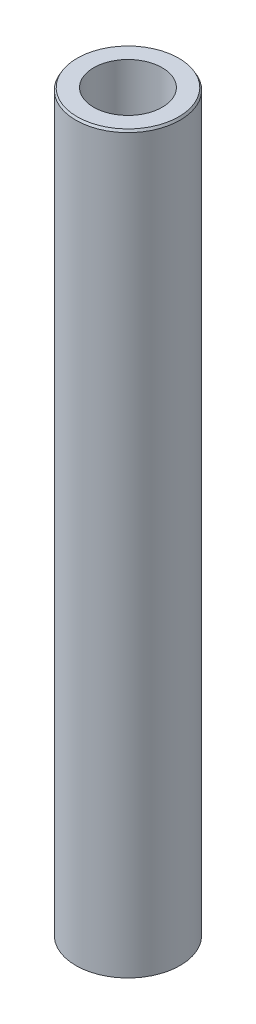
ISO-10303-21;
HEADER;
FILE_DESCRIPTION(('STEP AP214'),'2;1');
FILE_NAME('part.step','',(''),(''),'','','');
FILE_SCHEMA(('AUTOMOTIVE_DESIGN { 1 0 10303 214 1 1 1 1 }'));
ENDSEC;
DATA;
#1=APPLICATION_CONTEXT('core data for automotive mechanical design processes');
#2=APPLICATION_PROTOCOL_DEFINITION('international standard','automotive_design',2000,#1);
#3=PRODUCT_CONTEXT('',#1,'mechanical');
#4=PRODUCT('Part','Part','',(#3));
#5=PRODUCT_RELATED_PRODUCT_CATEGORY('part','',(#4));
#6=PRODUCT_DEFINITION_FORMATION('','',#4);
#7=PRODUCT_DEFINITION_CONTEXT('part definition',#1,'design');
#8=PRODUCT_DEFINITION('design','',#6,#7);
#9=PRODUCT_DEFINITION_SHAPE('','',#8);
#10=(LENGTH_UNIT() NAMED_UNIT(*) SI_UNIT(.MILLI.,.METRE.));
#11=(NAMED_UNIT(*) PLANE_ANGLE_UNIT() SI_UNIT($,.RADIAN.));
#12=(NAMED_UNIT(*) SI_UNIT($,.STERADIAN.) SOLID_ANGLE_UNIT());
#13=UNCERTAINTY_MEASURE_WITH_UNIT(LENGTH_MEASURE(1.E-05),#10,'distance_accuracy_value','');
#14=(GEOMETRIC_REPRESENTATION_CONTEXT(3) GLOBAL_UNCERTAINTY_ASSIGNED_CONTEXT((#13)) GLOBAL_UNIT_ASSIGNED_CONTEXT((#10,
#11,#12)) REPRESENTATION_CONTEXT('',''));
#15=CARTESIAN_POINT('',(0.,0.,0.));
#16=DIRECTION('',(0.,0.,1.));
#17=DIRECTION('',(1.,0.,0.));
#18=AXIS2_PLACEMENT_3D('',#15,#16,#17);
#19=CARTESIAN_POINT('',(0.,600.,0.));
#20=DIRECTION('',(0.,-1.,0.));
#21=DIRECTION('',(0.,0.,-1.));
#22=AXIS2_PLACEMENT_3D('',#19,#20,#21);
#23=CYLINDRICAL_SURFACE('',#22,42.5);
#24=CARTESIAN_POINT('',(0.,598.133978782126,0.));
#25=DIRECTION('',(0.,1.,0.));
#26=DIRECTION('',(0.,0.,1.));
#27=AXIS2_PLACEMENT_3D('',#24,#25,#26);
#28=CIRCLE('',#27,42.5);
#29=CARTESIAN_POINT('',(0.,598.133978782126,42.5));
#30=VERTEX_POINT('',#29);
#31=EDGE_CURVE('E50',#30,#30,#28,.F.);
#32=ORIENTED_EDGE('',*,*,#31,.T.);
#33=EDGE_LOOP('',(#32));
#34=FACE_BOUND('',#33,.T.);
#35=CARTESIAN_POINT('',(0.,1.07734785245284,0.));
#36=DIRECTION('',(0.,1.,0.));
#37=DIRECTION('',(0.,0.,1.));
#38=AXIS2_PLACEMENT_3D('',#35,#36,#37);
#39=CIRCLE('',#38,42.5);
#40=CARTESIAN_POINT('',(0.,1.07734785245284,42.5));
#41=VERTEX_POINT('',#40);
#42=EDGE_CURVE('E51',#41,#41,#39,.T.);
#43=ORIENTED_EDGE('',*,*,#42,.T.);
#44=EDGE_LOOP('',(#43));
#45=FACE_BOUND('',#44,.T.);
#46=ADVANCED_FACE('F39',(#34,#45),#23,.T.);
#47=CARTESIAN_POINT('',(0.,600.,0.));
#48=DIRECTION('',(0.,1.,0.));
#49=DIRECTION('',(0.,0.,1.));
#50=AXIS2_PLACEMENT_3D('',#47,#48,#49);
#51=PLANE('',#50);
#52=CARTESIAN_POINT('',(0.,600.,0.));
#53=DIRECTION('',(0.,1.,0.));
#54=DIRECTION('',(0.,0.,1.));
#55=AXIS2_PLACEMENT_3D('',#52,#53,#54);
#56=CIRCLE('',#55,41.4226521475471);
#57=CARTESIAN_POINT('',(0.,600.,41.4226521475471));
#58=VERTEX_POINT('',#57);
#59=EDGE_CURVE('E54',#58,#58,#56,.T.);
#60=ORIENTED_EDGE('',*,*,#59,.T.);
#61=EDGE_LOOP('',(#60));
#62=FACE_BOUND('',#61,.T.);
#63=CARTESIAN_POINT('',(0.,600.,0.));
#64=DIRECTION('',(0.,1.,0.));
#65=DIRECTION('',(0.,0.,1.));
#66=AXIS2_PLACEMENT_3D('',#63,#64,#65);
#67=CIRCLE('',#66,27.9580902125447);
#68=CARTESIAN_POINT('',(0.,600.,27.9580902125447));
#69=VERTEX_POINT('',#68);
#70=EDGE_CURVE('E58',#69,#69,#67,.T.);
#71=ORIENTED_EDGE('',*,*,#70,.F.);
#72=EDGE_LOOP('',(#71));
#73=FACE_BOUND('',#72,.T.);
#74=ADVANCED_FACE('F69',(#62,#73),#51,.T.);
#75=CARTESIAN_POINT('',(0.,0.,0.));
#76=DIRECTION('',(0.,1.,0.));
#77=DIRECTION('',(0.,0.,1.));
#78=AXIS2_PLACEMENT_3D('',#75,#76,#77);
#79=PLANE('',#78);
#80=CARTESIAN_POINT('',(0.,0.,0.));
#81=DIRECTION('',(0.,1.,0.));
#82=DIRECTION('',(0.,0.,1.));
#83=AXIS2_PLACEMENT_3D('',#80,#81,#82);
#84=CIRCLE('',#83,40.6339787821265);
#85=CARTESIAN_POINT('',(0.,0.,40.6339787821265));
#86=VERTEX_POINT('',#85);
#87=EDGE_CURVE('E10',#86,#86,#84,.F.);
#88=ORIENTED_EDGE('',*,*,#87,.T.);
#89=EDGE_LOOP('',(#88));
#90=FACE_BOUND('',#89,.T.);
#91=CARTESIAN_POINT('',(0.,0.,0.));
#92=DIRECTION('',(0.,1.,0.));
#93=DIRECTION('',(0.,0.,1.));
#94=AXIS2_PLACEMENT_3D('',#91,#92,#93);
#95=CIRCLE('',#94,27.9580902125447);
#96=CARTESIAN_POINT('',(0.,0.,27.9580902125447));
#97=VERTEX_POINT('',#96);
#98=EDGE_CURVE('E63',#97,#97,#95,.T.);
#99=ORIENTED_EDGE('',*,*,#98,.T.);
#100=EDGE_LOOP('',(#99));
#101=FACE_BOUND('',#100,.T.);
#102=ADVANCED_FACE('F75',(#90,#101),#79,.F.);
#103=CARTESIAN_POINT('',(0.,600.,0.));
#104=DIRECTION('',(0.,-1.,0.));
#105=DIRECTION('',(0.,0.,-1.));
#106=AXIS2_PLACEMENT_3D('',#103,#104,#105);
#107=CYLINDRICAL_SURFACE('',#106,27.9580902125447);
#108=ORIENTED_EDGE('',*,*,#70,.T.);
#109=EDGE_LOOP('',(#108));
#110=FACE_BOUND('',#109,.T.);
#111=ORIENTED_EDGE('',*,*,#98,.F.);
#112=EDGE_LOOP('',(#111));
#113=FACE_BOUND('',#112,.T.);
#114=ADVANCED_FACE('F70',(#110,#113),#107,.F.);
#115=CARTESIAN_POINT('',(0.,600.,0.));
#116=DIRECTION('',(0.,-1.,0.));
#117=DIRECTION('',(0.,0.,-1.));
#118=AXIS2_PLACEMENT_3D('',#115,#116,#117);
#119=CONICAL_SURFACE('',#118,41.4226521475471,0.52359877559829);
#120=ORIENTED_EDGE('',*,*,#31,.F.);
#121=EDGE_LOOP('',(#120));
#122=FACE_BOUND('',#121,.T.);
#123=ORIENTED_EDGE('',*,*,#59,.F.);
#124=EDGE_LOOP('',(#123));
#125=FACE_BOUND('',#124,.T.);
#126=ADVANCED_FACE('F81',(#122,#125),#119,.T.);
#127=CARTESIAN_POINT('',(0.,1.07734785245284,0.));
#128=DIRECTION('',(0.,1.,0.));
#129=DIRECTION('',(0.,0.,1.));
#130=AXIS2_PLACEMENT_3D('',#127,#128,#129);
#131=CONICAL_SURFACE('',#130,42.5,1.0471975511966);
#132=ORIENTED_EDGE('',*,*,#87,.F.);
#133=EDGE_LOOP('',(#132));
#134=FACE_BOUND('',#133,.T.);
#135=ORIENTED_EDGE('',*,*,#42,.F.);
#136=EDGE_LOOP('',(#135));
#137=FACE_BOUND('',#136,.T.);
#138=ADVANCED_FACE('F45',(#134,#137),#131,.T.);
#139=CLOSED_SHELL('',(#46,#74,#102,#114,#126,#138));
#140=MANIFOLD_SOLID_BREP('B2',#139);
#141=ADVANCED_BREP_SHAPE_REPRESENTATION('',(#18,#140),#14);
#142=SHAPE_DEFINITION_REPRESENTATION(#9,#141);
ENDSEC;
END-ISO-10303-21;
